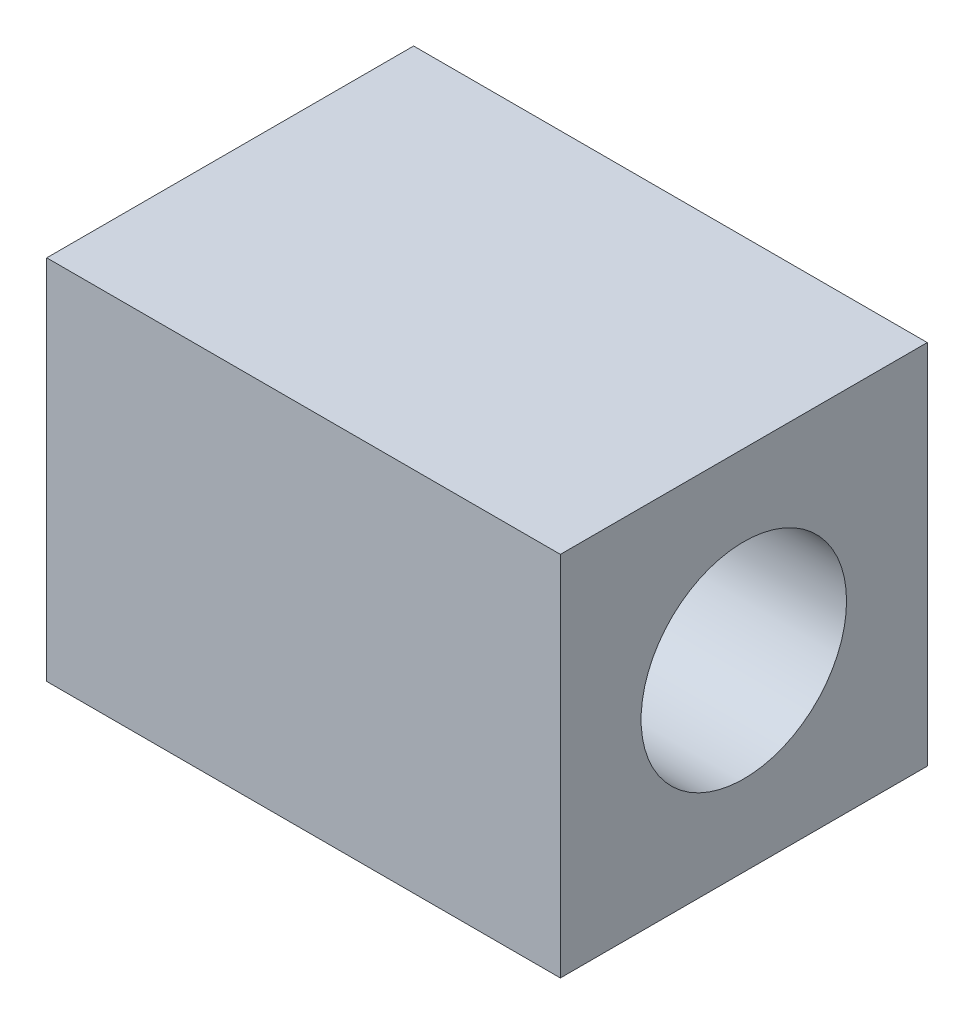
ISO-10303-21;
HEADER;
FILE_DESCRIPTION(('STEP AP214'),'2;1');
FILE_NAME('part.step','',(''),(''),'','','');
FILE_SCHEMA(('AUTOMOTIVE_DESIGN { 1 0 10303 214 1 1 1 1 }'));
ENDSEC;
DATA;
#1=APPLICATION_CONTEXT('core data for automotive mechanical design processes');
#2=APPLICATION_PROTOCOL_DEFINITION('international standard','automotive_design',2000,#1);
#3=PRODUCT_CONTEXT('',#1,'mechanical');
#4=PRODUCT('Part','Part','',(#3));
#5=PRODUCT_RELATED_PRODUCT_CATEGORY('part','',(#4));
#6=PRODUCT_DEFINITION_FORMATION('','',#4);
#7=PRODUCT_DEFINITION_CONTEXT('part definition',#1,'design');
#8=PRODUCT_DEFINITION('design','',#6,#7);
#9=PRODUCT_DEFINITION_SHAPE('','',#8);
#10=(LENGTH_UNIT() NAMED_UNIT(*) SI_UNIT(.MILLI.,.METRE.));
#11=(NAMED_UNIT(*) PLANE_ANGLE_UNIT() SI_UNIT($,.RADIAN.));
#12=(NAMED_UNIT(*) SI_UNIT($,.STERADIAN.) SOLID_ANGLE_UNIT());
#13=UNCERTAINTY_MEASURE_WITH_UNIT(LENGTH_MEASURE(1.E-05),#10,'distance_accuracy_value','');
#14=(GEOMETRIC_REPRESENTATION_CONTEXT(3) GLOBAL_UNCERTAINTY_ASSIGNED_CONTEXT((#13)) GLOBAL_UNIT_ASSIGNED_CONTEXT((#10,
#11,#12)) REPRESENTATION_CONTEXT('',''));
#15=CARTESIAN_POINT('',(0.,0.,0.));
#16=DIRECTION('',(0.,0.,1.));
#17=DIRECTION('',(1.,0.,0.));
#18=AXIS2_PLACEMENT_3D('',#15,#16,#17);
#19=CARTESIAN_POINT('',(22.225,0.,0.));
#20=DIRECTION('',(1.,0.,0.));
#21=DIRECTION('',(0.,0.,-1.));
#22=AXIS2_PLACEMENT_3D('',#19,#20,#21);
#23=PLANE('',#22);
#24=DIRECTION('',(0.,1.,0.));
#25=VECTOR('',#24,1.);
#26=CARTESIAN_POINT('',(22.225,15.875,-15.875));
#27=LINE('',#26,#25);
#28=CARTESIAN_POINT('',(22.225,-15.875,-15.875));
#29=VERTEX_POINT('',#28);
#30=CARTESIAN_POINT('',(22.225,15.875,-15.875));
#31=VERTEX_POINT('',#30);
#32=EDGE_CURVE('E85',#29,#31,#27,.T.);
#33=ORIENTED_EDGE('',*,*,#32,.T.);
#34=DIRECTION('',(0.,0.,1.));
#35=VECTOR('',#34,1.);
#36=CARTESIAN_POINT('',(22.225,15.875,15.875));
#37=LINE('',#36,#35);
#38=CARTESIAN_POINT('',(22.225,15.875,15.875));
#39=VERTEX_POINT('',#38);
#40=EDGE_CURVE('E80',#31,#39,#37,.T.);
#41=ORIENTED_EDGE('',*,*,#40,.T.);
#42=DIRECTION('',(0.,-1.,0.));
#43=VECTOR('',#42,1.);
#44=CARTESIAN_POINT('',(22.225,15.875,15.875));
#45=LINE('',#44,#43);
#46=CARTESIAN_POINT('',(22.225,-15.875,15.875));
#47=VERTEX_POINT('',#46);
#48=EDGE_CURVE('E83',#39,#47,#45,.T.);
#49=ORIENTED_EDGE('',*,*,#48,.T.);
#50=DIRECTION('',(0.,0.,-1.));
#51=VECTOR('',#50,1.);
#52=CARTESIAN_POINT('',(22.225,-15.875,15.875));
#53=LINE('',#52,#51);
#54=EDGE_CURVE('E50',#47,#29,#53,.T.);
#55=ORIENTED_EDGE('',*,*,#54,.T.);
#56=EDGE_LOOP('',(#33,#41,#49,#55));
#57=FACE_BOUND('',#56,.T.);
#58=CARTESIAN_POINT('',(22.225,0.,0.));
#59=DIRECTION('',(1.,0.,0.));
#60=DIRECTION('',(0.,0.,-1.));
#61=AXIS2_PLACEMENT_3D('',#58,#59,#60);
#62=CIRCLE('',#61,8.89);
#63=CARTESIAN_POINT('',(22.225,0.,-8.89));
#64=VERTEX_POINT('',#63);
#65=EDGE_CURVE('E100',#64,#64,#62,.T.);
#66=ORIENTED_EDGE('',*,*,#65,.F.);
#67=EDGE_LOOP('',(#66));
#68=FACE_BOUND('',#67,.T.);
#69=ADVANCED_FACE('F33',(#57,#68),#23,.T.);
#70=CARTESIAN_POINT('',(-22.225,0.,0.));
#71=DIRECTION('',(1.,0.,0.));
#72=DIRECTION('',(0.,0.,-1.));
#73=AXIS2_PLACEMENT_3D('',#70,#71,#72);
#74=PLANE('',#73);
#75=DIRECTION('',(0.,1.,0.));
#76=VECTOR('',#75,1.);
#77=CARTESIAN_POINT('',(-22.225,15.875,-15.875));
#78=LINE('',#77,#76);
#79=CARTESIAN_POINT('',(-22.225,-15.875,-15.875));
#80=VERTEX_POINT('',#79);
#81=CARTESIAN_POINT('',(-22.225,15.875,-15.875));
#82=VERTEX_POINT('',#81);
#83=EDGE_CURVE('E97',#80,#82,#78,.T.);
#84=ORIENTED_EDGE('',*,*,#83,.F.);
#85=DIRECTION('',(0.,0.,-1.));
#86=VECTOR('',#85,1.);
#87=CARTESIAN_POINT('',(-22.225,-15.875,15.875));
#88=LINE('',#87,#86);
#89=CARTESIAN_POINT('',(-22.225,-15.875,15.875));
#90=VERTEX_POINT('',#89);
#91=EDGE_CURVE('E73',#90,#80,#88,.T.);
#92=ORIENTED_EDGE('',*,*,#91,.F.);
#93=DIRECTION('',(0.,-1.,0.));
#94=VECTOR('',#93,1.);
#95=CARTESIAN_POINT('',(-22.225,15.875,15.875));
#96=LINE('',#95,#94);
#97=CARTESIAN_POINT('',(-22.225,15.875,15.875));
#98=VERTEX_POINT('',#97);
#99=EDGE_CURVE('E67',#98,#90,#96,.T.);
#100=ORIENTED_EDGE('',*,*,#99,.F.);
#101=DIRECTION('',(0.,0.,1.));
#102=VECTOR('',#101,1.);
#103=CARTESIAN_POINT('',(-22.225,15.875,15.875));
#104=LINE('',#103,#102);
#105=EDGE_CURVE('E89',#82,#98,#104,.T.);
#106=ORIENTED_EDGE('',*,*,#105,.F.);
#107=EDGE_LOOP('',(#84,#92,#100,#106));
#108=FACE_BOUND('',#107,.T.);
#109=CARTESIAN_POINT('',(-22.225,0.,0.));
#110=DIRECTION('',(1.,0.,0.));
#111=DIRECTION('',(0.,0.,-1.));
#112=AXIS2_PLACEMENT_3D('',#109,#110,#111);
#113=CIRCLE('',#112,8.89);
#114=CARTESIAN_POINT('',(-22.225,0.,-8.89));
#115=VERTEX_POINT('',#114);
#116=EDGE_CURVE('E112',#115,#115,#113,.T.);
#117=ORIENTED_EDGE('',*,*,#116,.T.);
#118=EDGE_LOOP('',(#117));
#119=FACE_BOUND('',#118,.T.);
#120=ADVANCED_FACE('F108',(#108,#119),#74,.F.);
#121=CARTESIAN_POINT('',(22.225,15.875,-15.875));
#122=DIRECTION('',(0.,0.,1.));
#123=DIRECTION('',(1.,0.,0.));
#124=AXIS2_PLACEMENT_3D('',#121,#122,#123);
#125=PLANE('',#124);
#126=ORIENTED_EDGE('',*,*,#83,.T.);
#127=DIRECTION('',(-1.,0.,0.));
#128=VECTOR('',#127,1.);
#129=CARTESIAN_POINT('',(22.225,15.875,-15.875));
#130=LINE('',#129,#128);
#131=EDGE_CURVE('E11',#31,#82,#130,.T.);
#132=ORIENTED_EDGE('',*,*,#131,.F.);
#133=ORIENTED_EDGE('',*,*,#32,.F.);
#134=DIRECTION('',(-1.,0.,0.));
#135=VECTOR('',#134,1.);
#136=CARTESIAN_POINT('',(22.225,-15.875,-15.875));
#137=LINE('',#136,#135);
#138=EDGE_CURVE('E93',#29,#80,#137,.T.);
#139=ORIENTED_EDGE('',*,*,#138,.T.);
#140=EDGE_LOOP('',(#126,#132,#133,#139));
#141=FACE_BOUND('',#140,.T.);
#142=ADVANCED_FACE('F35',(#141),#125,.F.);
#143=CARTESIAN_POINT('',(22.225,15.875,15.875));
#144=DIRECTION('',(0.,-1.,0.));
#145=DIRECTION('',(0.,0.,-1.));
#146=AXIS2_PLACEMENT_3D('',#143,#144,#145);
#147=PLANE('',#146);
#148=ORIENTED_EDGE('',*,*,#105,.T.);
#149=DIRECTION('',(-1.,0.,0.));
#150=VECTOR('',#149,1.);
#151=CARTESIAN_POINT('',(22.225,15.875,15.875));
#152=LINE('',#151,#150);
#153=EDGE_CURVE('E42',#39,#98,#152,.T.);
#154=ORIENTED_EDGE('',*,*,#153,.F.);
#155=ORIENTED_EDGE('',*,*,#40,.F.);
#156=ORIENTED_EDGE('',*,*,#131,.T.);
#157=EDGE_LOOP('',(#148,#154,#155,#156));
#158=FACE_BOUND('',#157,.T.);
#159=ADVANCED_FACE('F88',(#158),#147,.F.);
#160=CARTESIAN_POINT('',(22.225,15.875,15.875));
#161=DIRECTION('',(0.,0.,-1.));
#162=DIRECTION('',(0.,1.,0.));
#163=AXIS2_PLACEMENT_3D('',#160,#161,#162);
#164=PLANE('',#163);
#165=ORIENTED_EDGE('',*,*,#99,.T.);
#166=DIRECTION('',(-1.,0.,0.));
#167=VECTOR('',#166,1.);
#168=CARTESIAN_POINT('',(22.225,-15.875,15.875));
#169=LINE('',#168,#167);
#170=EDGE_CURVE('E90',#47,#90,#169,.T.);
#171=ORIENTED_EDGE('',*,*,#170,.F.);
#172=ORIENTED_EDGE('',*,*,#48,.F.);
#173=ORIENTED_EDGE('',*,*,#153,.T.);
#174=EDGE_LOOP('',(#165,#171,#172,#173));
#175=FACE_BOUND('',#174,.T.);
#176=ADVANCED_FACE('F91',(#175),#164,.F.);
#177=CARTESIAN_POINT('',(22.225,-15.875,15.875));
#178=DIRECTION('',(0.,1.,0.));
#179=DIRECTION('',(0.,0.,1.));
#180=AXIS2_PLACEMENT_3D('',#177,#178,#179);
#181=PLANE('',#180);
#182=ORIENTED_EDGE('',*,*,#91,.T.);
#183=ORIENTED_EDGE('',*,*,#138,.F.);
#184=ORIENTED_EDGE('',*,*,#54,.F.);
#185=ORIENTED_EDGE('',*,*,#170,.T.);
#186=EDGE_LOOP('',(#182,#183,#184,#185));
#187=FACE_BOUND('',#186,.T.);
#188=ADVANCED_FACE('F105',(#187),#181,.F.);
#189=CARTESIAN_POINT('',(22.225,0.,0.));
#190=DIRECTION('',(-1.,0.,0.));
#191=DIRECTION('',(0.,0.,1.));
#192=AXIS2_PLACEMENT_3D('',#189,#190,#191);
#193=CYLINDRICAL_SURFACE('',#192,8.89);
#194=ORIENTED_EDGE('',*,*,#65,.T.);
#195=EDGE_LOOP('',(#194));
#196=FACE_BOUND('',#195,.T.);
#197=ORIENTED_EDGE('',*,*,#116,.F.);
#198=EDGE_LOOP('',(#197));
#199=FACE_BOUND('',#198,.T.);
#200=ADVANCED_FACE('F118',(#196,#199),#193,.F.);
#201=CLOSED_SHELL('',(#69,#120,#142,#159,#176,#188,#200));
#202=MANIFOLD_SOLID_BREP('B2',#201);
#203=ADVANCED_BREP_SHAPE_REPRESENTATION('',(#18,#202),#14);
#204=SHAPE_DEFINITION_REPRESENTATION(#9,#203);
ENDSEC;
END-ISO-10303-21;
